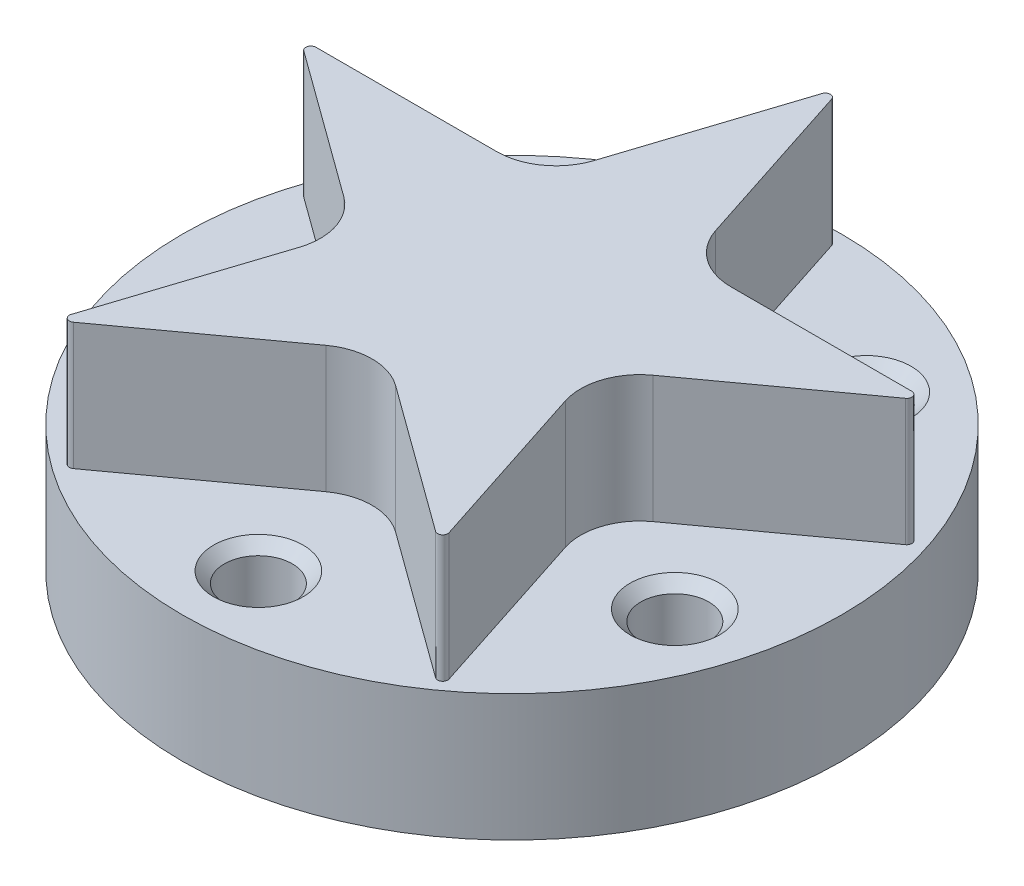
ISO-10303-21;
HEADER;
FILE_DESCRIPTION(('STEP AP214'),'2;1');
FILE_NAME('part.step','',(''),(''),'','','');
FILE_SCHEMA(('AUTOMOTIVE_DESIGN { 1 0 10303 214 1 1 1 1 }'));
ENDSEC;
DATA;
#1=APPLICATION_CONTEXT('core data for automotive mechanical design processes');
#2=APPLICATION_PROTOCOL_DEFINITION('international standard','automotive_design',2000,#1);
#3=PRODUCT_CONTEXT('',#1,'mechanical');
#4=PRODUCT('Part','Part','',(#3));
#5=PRODUCT_RELATED_PRODUCT_CATEGORY('part','',(#4));
#6=PRODUCT_DEFINITION_FORMATION('','',#4);
#7=PRODUCT_DEFINITION_CONTEXT('part definition',#1,'design');
#8=PRODUCT_DEFINITION('design','',#6,#7);
#9=PRODUCT_DEFINITION_SHAPE('','',#8);
#10=(LENGTH_UNIT() NAMED_UNIT(*) SI_UNIT(.MILLI.,.METRE.));
#11=(NAMED_UNIT(*) PLANE_ANGLE_UNIT() SI_UNIT($,.RADIAN.));
#12=(NAMED_UNIT(*) SI_UNIT($,.STERADIAN.) SOLID_ANGLE_UNIT());
#13=UNCERTAINTY_MEASURE_WITH_UNIT(LENGTH_MEASURE(1.E-05),#10,'distance_accuracy_value','');
#14=(GEOMETRIC_REPRESENTATION_CONTEXT(3) GLOBAL_UNCERTAINTY_ASSIGNED_CONTEXT((#13)) GLOBAL_UNIT_ASSIGNED_CONTEXT((#10,
#11,#12)) REPRESENTATION_CONTEXT('',''));
#15=CARTESIAN_POINT('',(0.,0.,0.));
#16=DIRECTION('',(0.,0.,1.));
#17=DIRECTION('',(1.,0.,0.));
#18=AXIS2_PLACEMENT_3D('',#15,#16,#17);
#19=CARTESIAN_POINT('',(0.,19.05,0.));
#20=DIRECTION('',(0.,-1.,0.));
#21=DIRECTION('',(0.,0.,-1.));
#22=AXIS2_PLACEMENT_3D('',#19,#20,#21);
#23=CYLINDRICAL_SURFACE('',#22,24.765);
#24=CARTESIAN_POINT('',(0.,0.,0.));
#25=DIRECTION('',(0.,1.,0.));
#26=DIRECTION('',(0.,0.,1.));
#27=AXIS2_PLACEMENT_3D('',#24,#25,#26);
#28=CIRCLE('',#27,24.765);
#29=CARTESIAN_POINT('',(0.,0.,24.765));
#30=VERTEX_POINT('',#29);
#31=EDGE_CURVE('E13',#30,#30,#28,.T.);
#32=ORIENTED_EDGE('',*,*,#31,.T.);
#33=EDGE_LOOP('',(#32));
#34=FACE_BOUND('',#33,.T.);
#35=CARTESIAN_POINT('',(0.,9.525,0.));
#36=DIRECTION('',(0.,1.,0.));
#37=DIRECTION('',(0.,0.,1.));
#38=AXIS2_PLACEMENT_3D('',#35,#36,#37);
#39=CIRCLE('',#38,24.765);
#40=CARTESIAN_POINT('',(0.,9.525,24.765));
#41=VERTEX_POINT('',#40);
#42=EDGE_CURVE('E53',#41,#41,#39,.T.);
#43=ORIENTED_EDGE('',*,*,#42,.F.);
#44=EDGE_LOOP('',(#43));
#45=FACE_BOUND('',#44,.T.);
#46=ADVANCED_FACE('F50',(#34,#45),#23,.T.);
#47=CARTESIAN_POINT('',(0.,0.,0.));
#48=DIRECTION('',(0.,1.,0.));
#49=DIRECTION('',(0.,0.,1.));
#50=AXIS2_PLACEMENT_3D('',#47,#48,#49);
#51=PLANE('',#50);
#52=ORIENTED_EDGE('',*,*,#31,.F.);
#53=EDGE_LOOP('',(#52));
#54=FACE_BOUND('',#53,.T.);
#55=ADVANCED_FACE('F253',(#54),#51,.F.);
#56=CARTESIAN_POINT('',(0.,9.525,0.));
#57=DIRECTION('',(0.,1.,0.));
#58=DIRECTION('',(0.,0.,1.));
#59=AXIS2_PLACEMENT_3D('',#56,#57,#58);
#60=PLANE('',#59);
#61=CARTESIAN_POINT('',(-18.1176266354227,9.525,5.88677374284274));
#62=DIRECTION('',(0.,1.,0.));
#63=DIRECTION('',(0.,0.,1.));
#64=AXIS2_PLACEMENT_3D('',#61,#62,#63);
#65=CIRCLE('',#64,3.3655);
#66=CARTESIAN_POINT('',(-18.1176266354227,9.525,9.25227374284274));
#67=VERTEX_POINT('',#66);
#68=EDGE_CURVE('E220',#67,#67,#65,.T.);
#69=ORIENTED_EDGE('',*,*,#68,.F.);
#70=EDGE_LOOP('',(#69));
#71=FACE_BOUND('',#70,.T.);
#72=CARTESIAN_POINT('',(-11.1973090561716,9.525,-15.4117737428428));
#73=DIRECTION('',(0.,1.,0.));
#74=DIRECTION('',(0.,0.,1.));
#75=AXIS2_PLACEMENT_3D('',#72,#73,#74);
#76=CIRCLE('',#75,3.3655);
#77=CARTESIAN_POINT('',(-11.1973090561716,9.525,-12.0462737428428));
#78=VERTEX_POINT('',#77);
#79=EDGE_CURVE('E213',#78,#78,#76,.T.);
#80=ORIENTED_EDGE('',*,*,#79,.F.);
#81=EDGE_LOOP('',(#80));
#82=FACE_BOUND('',#81,.T.);
#83=CARTESIAN_POINT('',(11.1973090561716,9.525,-15.4117737428428));
#84=DIRECTION('',(0.,1.,0.));
#85=DIRECTION('',(0.,0.,1.));
#86=AXIS2_PLACEMENT_3D('',#83,#84,#85);
#87=CIRCLE('',#86,3.3655);
#88=CARTESIAN_POINT('',(11.1973090561716,9.525,-12.0462737428428));
#89=VERTEX_POINT('',#88);
#90=EDGE_CURVE('E230',#89,#89,#87,.T.);
#91=ORIENTED_EDGE('',*,*,#90,.F.);
#92=EDGE_LOOP('',(#91));
#93=FACE_BOUND('',#92,.T.);
#94=CARTESIAN_POINT('',(18.1176266354227,9.525,5.88677374284274));
#95=DIRECTION('',(0.,1.,0.));
#96=DIRECTION('',(0.,0.,1.));
#97=AXIS2_PLACEMENT_3D('',#94,#95,#96);
#98=CIRCLE('',#97,3.3655);
#99=CARTESIAN_POINT('',(18.1176266354227,9.525,9.25227374284274));
#100=VERTEX_POINT('',#99);
#101=EDGE_CURVE('E262',#100,#100,#98,.T.);
#102=ORIENTED_EDGE('',*,*,#101,.F.);
#103=EDGE_LOOP('',(#102));
#104=FACE_BOUND('',#103,.T.);
#105=CARTESIAN_POINT('',(1.93298336302911E-13,9.525,19.05));
#106=DIRECTION('',(0.,1.,0.));
#107=DIRECTION('',(0.,0.,1.));
#108=AXIS2_PLACEMENT_3D('',#105,#106,#107);
#109=CIRCLE('',#108,3.3655);
#110=CARTESIAN_POINT('',(1.93298336302911E-13,9.525,22.4155));
#111=VERTEX_POINT('',#110);
#112=EDGE_CURVE('E265',#111,#111,#109,.T.);
#113=ORIENTED_EDGE('',*,*,#112,.F.);
#114=EDGE_LOOP('',(#113));
#115=FACE_BOUND('',#114,.T.);
#116=DIRECTION('',(-0.309016994374948,0.,0.951056516295154));
#117=VECTOR('',#116,1.);
#118=CARTESIAN_POINT('',(-4.56212424204858,9.525,-10.724225325699));
#119=LINE('',#118,#117);
#120=CARTESIAN_POINT('',(-0.362352532708458,9.525,-23.6497935754294));
#121=VERTEX_POINT('',#120);
#122=CARTESIAN_POINT('',(-4.56212424204858,9.525,-10.724225325699));
#123=VERTEX_POINT('',#122);
#124=EDGE_CURVE('E271',#121,#123,#119,.T.);
#125=ORIENTED_EDGE('',*,*,#124,.F.);
#126=CARTESIAN_POINT('',(0.,9.525,-23.5320581005726));
#127=DIRECTION('',(0.,1.,0.));
#128=DIRECTION('',(0.,0.,1.));
#129=AXIS2_PLACEMENT_3D('',#126,#127,#128);
#130=CIRCLE('',#129,0.381);
#131=CARTESIAN_POINT('',(0.362352532708458,9.525,-23.6497935754294));
#132=VERTEX_POINT('',#131);
#133=EDGE_CURVE('E328',#132,#121,#130,.T.);
#134=ORIENTED_EDGE('',*,*,#133,.F.);
#135=DIRECTION('',(-0.309016994374948,0.,-0.951056516295154));
#136=VECTOR('',#135,1.);
#137=CARTESIAN_POINT('',(0.362352532708458,9.525,-23.6497935754294));
#138=LINE('',#137,#136);
#139=CARTESIAN_POINT('',(4.56212424204858,9.525,-10.724225325699));
#140=VERTEX_POINT('',#139);
#141=EDGE_CURVE('E331',#140,#132,#138,.T.);
#142=ORIENTED_EDGE('',*,*,#141,.F.);
#143=CARTESIAN_POINT('',(8.78957045698055,9.525,-12.0978058656956));
#144=DIRECTION('',(0.,-1.,0.));
#145=DIRECTION('',(0.,0.,1.));
#146=AXIS2_PLACEMENT_3D('',#143,#144,#145);
#147=CIRCLE('',#146,4.445);
#148=CARTESIAN_POINT('',(8.78957045698055,9.525,-7.65280586569557));
#149=VERTEX_POINT('',#148);
#150=EDGE_CURVE('E538',#149,#140,#147,.T.);
#151=ORIENTED_EDGE('',*,*,#150,.F.);
#152=DIRECTION('',(-1.,0.,0.));
#153=VECTOR('',#152,1.);
#154=CARTESIAN_POINT('',(8.78957045698057,9.525,-7.65280586569557));
#155=LINE('',#154,#153);
#156=CARTESIAN_POINT('',(22.3803171983857,9.525,-7.65280586569557));
#157=VERTEX_POINT('',#156);
#158=EDGE_CURVE('E540',#157,#149,#155,.T.);
#159=ORIENTED_EDGE('',*,*,#158,.F.);
#160=CARTESIAN_POINT('',(22.3803171983857,9.525,-7.27180586569557));
#161=DIRECTION('',(0.,1.,0.));
#162=DIRECTION('',(0.,0.,1.));
#163=AXIS2_PLACEMENT_3D('',#160,#161,#162);
#164=CIRCLE('',#163,0.380999999999999);
#165=CARTESIAN_POINT('',(22.6042633795091,9.525,-6.96357039083871));
#166=VERTEX_POINT('',#165);
#167=EDGE_CURVE('E553',#166,#157,#164,.T.);
#168=ORIENTED_EDGE('',*,*,#167,.F.);
#169=DIRECTION('',(0.809016994374947,0.,-0.587785252292473));
#170=VECTOR('',#169,1.);
#171=CARTESIAN_POINT('',(22.6042633795091,9.525,-6.96357039083871));
#172=LINE('',#171,#170);
#173=CARTESIAN_POINT('',(11.6091182994664,9.525,1.0248701114012));
#174=VERTEX_POINT('',#173);
#175=EDGE_CURVE('E558',#174,#166,#172,.T.);
#176=ORIENTED_EDGE('',*,*,#175,.F.);
#177=CARTESIAN_POINT('',(14.2218237459065,9.525,4.62095065139786));
#178=DIRECTION('',(0.,-1.,0.));
#179=DIRECTION('',(0.,0.,1.));
#180=AXIS2_PLACEMENT_3D('',#177,#178,#179);
#181=CIRCLE('',#180,4.445);
#182=CARTESIAN_POINT('',(9.99437753097452,9.525,5.99453119139452));
#183=VERTEX_POINT('',#182);
#184=EDGE_CURVE('E563',#183,#174,#181,.T.);
#185=ORIENTED_EDGE('',*,*,#184,.F.);
#186=DIRECTION('',(-0.309016994374948,0.,-0.951056516295154));
#187=VECTOR('',#186,1.);
#188=CARTESIAN_POINT('',(9.99437753097452,9.525,5.99453119139452));
#189=LINE('',#188,#187);
#190=CARTESIAN_POINT('',(14.1941492403146,9.525,18.920099441125));
#191=VERTEX_POINT('',#190);
#192=EDGE_CURVE('E576',#191,#183,#189,.T.);
#193=ORIENTED_EDGE('',*,*,#192,.F.);
#194=CARTESIAN_POINT('',(13.8317967076062,9.525,19.0378349159819));
#195=DIRECTION('',(0.,1.,0.));
#196=DIRECTION('',(0.,0.,1.));
#197=AXIS2_PLACEMENT_3D('',#194,#195,#196);
#198=CIRCLE('',#197,0.381000000000001);
#199=CARTESIAN_POINT('',(13.6078505264827,9.525,19.3460703908387));
#200=VERTEX_POINT('',#199);
#201=EDGE_CURVE('E572',#200,#191,#198,.T.);
#202=ORIENTED_EDGE('',*,*,#201,.F.);
#203=DIRECTION('',(0.809016994374947,0.,0.587785252292473));
#204=VECTOR('',#203,1.);
#205=CARTESIAN_POINT('',(13.6078505264827,9.525,19.3460703908387));
#206=LINE('',#205,#204);
#207=CARTESIAN_POINT('',(2.61270544644007,9.525,11.3576298885988));
#208=VERTEX_POINT('',#207);
#209=EDGE_CURVE('E577',#208,#200,#206,.T.);
#210=ORIENTED_EDGE('',*,*,#209,.F.);
#211=CARTESIAN_POINT('',(0.,9.525,14.9537104285954));
#212=DIRECTION('',(0.,-1.,0.));
#213=DIRECTION('',(0.,0.,1.));
#214=AXIS2_PLACEMENT_3D('',#211,#212,#213);
#215=CIRCLE('',#214,4.445);
#216=CARTESIAN_POINT('',(-2.61270544644006,9.525,11.3576298885988));
#217=VERTEX_POINT('',#216);
#218=EDGE_CURVE('E601',#217,#208,#215,.T.);
#219=ORIENTED_EDGE('',*,*,#218,.F.);
#220=DIRECTION('',(0.809016994374947,0.,-0.587785252292473));
#221=VECTOR('',#220,1.);
#222=CARTESIAN_POINT('',(-2.61270544644006,9.525,11.3576298885988));
#223=LINE('',#222,#221);
#224=CARTESIAN_POINT('',(-13.6078505264827,9.525,19.3460703908387));
#225=VERTEX_POINT('',#224);
#226=EDGE_CURVE('E603',#225,#217,#223,.T.);
#227=ORIENTED_EDGE('',*,*,#226,.F.);
#228=CARTESIAN_POINT('',(-13.8317967076062,9.525,19.0378349159819));
#229=DIRECTION('',(0.,1.,0.));
#230=DIRECTION('',(0.,0.,1.));
#231=AXIS2_PLACEMENT_3D('',#228,#229,#230);
#232=CIRCLE('',#231,0.381);
#233=CARTESIAN_POINT('',(-14.1941492403146,9.525,18.920099441125));
#234=VERTEX_POINT('',#233);
#235=EDGE_CURVE('E606',#234,#225,#232,.T.);
#236=ORIENTED_EDGE('',*,*,#235,.F.);
#237=DIRECTION('',(-0.309016994374948,0.,0.951056516295153));
#238=VECTOR('',#237,1.);
#239=CARTESIAN_POINT('',(-14.1941492403146,9.525,18.920099441125));
#240=LINE('',#239,#238);
#241=CARTESIAN_POINT('',(-9.99437753097451,9.525,5.99453119139453));
#242=VERTEX_POINT('',#241);
#243=EDGE_CURVE('E619',#242,#234,#240,.T.);
#244=ORIENTED_EDGE('',*,*,#243,.F.);
#245=CARTESIAN_POINT('',(-14.2218237459065,9.525,4.62095065139786));
#246=DIRECTION('',(0.,-1.,0.));
#247=DIRECTION('',(0.,0.,1.));
#248=AXIS2_PLACEMENT_3D('',#245,#246,#247);
#249=CIRCLE('',#248,4.445);
#250=CARTESIAN_POINT('',(-11.6091182994664,9.525,1.02487011140121));
#251=VERTEX_POINT('',#250);
#252=EDGE_CURVE('E624',#251,#242,#249,.T.);
#253=ORIENTED_EDGE('',*,*,#252,.F.);
#254=DIRECTION('',(0.809016994374947,0.,0.587785252292473));
#255=VECTOR('',#254,1.);
#256=CARTESIAN_POINT('',(-11.6091182994664,9.525,1.02487011140121));
#257=LINE('',#256,#255);
#258=CARTESIAN_POINT('',(-22.6042633795091,9.525,-6.96357039083871));
#259=VERTEX_POINT('',#258);
#260=EDGE_CURVE('E630',#259,#251,#257,.T.);
#261=ORIENTED_EDGE('',*,*,#260,.F.);
#262=CARTESIAN_POINT('',(-22.3803171983857,9.525,-7.27180586569557));
#263=DIRECTION('',(0.,1.,0.));
#264=DIRECTION('',(0.,0.,1.));
#265=AXIS2_PLACEMENT_3D('',#262,#263,#264);
#266=CIRCLE('',#265,0.380999999999999);
#267=CARTESIAN_POINT('',(-22.3803171983857,9.525,-7.65280586569557));
#268=VERTEX_POINT('',#267);
#269=EDGE_CURVE('E74',#268,#259,#266,.T.);
#270=ORIENTED_EDGE('',*,*,#269,.F.);
#271=DIRECTION('',(-1.,0.,0.));
#272=VECTOR('',#271,1.);
#273=CARTESIAN_POINT('',(-22.3803171983857,9.525,-7.65280586569557));
#274=LINE('',#273,#272);
#275=CARTESIAN_POINT('',(-8.78957045698057,9.525,-7.65280586569557));
#276=VERTEX_POINT('',#275);
#277=EDGE_CURVE('E395',#276,#268,#274,.T.);
#278=ORIENTED_EDGE('',*,*,#277,.F.);
#279=CARTESIAN_POINT('',(-8.78957045698055,9.525,-12.0978058656956));
#280=DIRECTION('',(0.,-1.,0.));
#281=DIRECTION('',(0.,0.,-1.));
#282=AXIS2_PLACEMENT_3D('',#279,#280,#281);
#283=CIRCLE('',#282,4.445);
#284=EDGE_CURVE('E393',#123,#276,#283,.T.);
#285=ORIENTED_EDGE('',*,*,#284,.F.);
#286=EDGE_LOOP('',(#125,#134,#142,#151,#159,#168,#176,#185,#193,#202,#210,#219,#227,#236,#244,
#253,#261,#270,#278,#285));
#287=FACE_BOUND('',#286,.T.);
#288=ORIENTED_EDGE('',*,*,#42,.T.);
#289=EDGE_LOOP('',(#288));
#290=FACE_BOUND('',#289,.T.);
#291=ADVANCED_FACE('F249',(#71,#82,#93,#104,#115,#287,#290),#60,.T.);
#292=CARTESIAN_POINT('',(-8.78957045698055,9.525,-12.0978058656956));
#293=DIRECTION('',(0.,1.,0.));
#294=DIRECTION('',(0.,0.,1.));
#295=AXIS2_PLACEMENT_3D('',#292,#293,#294);
#296=CYLINDRICAL_SURFACE('',#295,4.445);
#297=CARTESIAN_POINT('',(-8.78957045698055,19.05,-12.0978058656956));
#298=DIRECTION('',(0.,-1.,0.));
#299=DIRECTION('',(0.,0.,-1.));
#300=AXIS2_PLACEMENT_3D('',#297,#298,#299);
#301=CIRCLE('',#300,4.445);
#302=CARTESIAN_POINT('',(-4.56212424204858,19.05,-10.724225325699));
#303=VERTEX_POINT('',#302);
#304=CARTESIAN_POINT('',(-8.78957045698057,19.05,-7.65280586569557));
#305=VERTEX_POINT('',#304);
#306=EDGE_CURVE('E336',#303,#305,#301,.T.);
#307=ORIENTED_EDGE('',*,*,#306,.F.);
#308=DIRECTION('',(0.,1.,0.));
#309=VECTOR('',#308,1.);
#310=CARTESIAN_POINT('',(-4.56212424204858,9.525,-10.724225325699));
#311=LINE('',#310,#309);
#312=EDGE_CURVE('E277',#123,#303,#311,.T.);
#313=ORIENTED_EDGE('',*,*,#312,.F.);
#314=ORIENTED_EDGE('',*,*,#284,.T.);
#315=DIRECTION('',(0.,1.,0.));
#316=VECTOR('',#315,1.);
#317=CARTESIAN_POINT('',(-8.78957045698057,9.525,-7.65280586569557));
#318=LINE('',#317,#316);
#319=EDGE_CURVE('E323',#276,#305,#318,.T.);
#320=ORIENTED_EDGE('',*,*,#319,.T.);
#321=EDGE_LOOP('',(#307,#313,#314,#320));
#322=FACE_BOUND('',#321,.T.);
#323=ADVANCED_FACE('F252',(#322),#296,.F.);
#324=CARTESIAN_POINT('',(-4.56212424204858,9.525,-10.724225325699));
#325=DIRECTION('',(-0.951056516295154,0.,-0.309016994374948));
#326=DIRECTION('',(-0.309016994374948,0.,0.951056516295154));
#327=AXIS2_PLACEMENT_3D('',#324,#325,#326);
#328=PLANE('',#327);
#329=DIRECTION('',(-0.309016994374948,0.,0.951056516295154));
#330=VECTOR('',#329,1.);
#331=CARTESIAN_POINT('',(-4.56212424204858,19.05,-10.724225325699));
#332=LINE('',#331,#330);
#333=CARTESIAN_POINT('',(-0.362352532708458,19.05,-23.6497935754294));
#334=VERTEX_POINT('',#333);
#335=EDGE_CURVE('E287',#334,#303,#332,.T.);
#336=ORIENTED_EDGE('',*,*,#335,.F.);
#337=DIRECTION('',(0.,1.,0.));
#338=VECTOR('',#337,1.);
#339=CARTESIAN_POINT('',(-0.362352532708458,9.525,-23.6497935754294));
#340=LINE('',#339,#338);
#341=EDGE_CURVE('E279',#121,#334,#340,.T.);
#342=ORIENTED_EDGE('',*,*,#341,.F.);
#343=ORIENTED_EDGE('',*,*,#124,.T.);
#344=ORIENTED_EDGE('',*,*,#312,.T.);
#345=EDGE_LOOP('',(#336,#342,#343,#344));
#346=FACE_BOUND('',#345,.T.);
#347=ADVANCED_FACE('F458',(#346),#328,.T.);
#348=CARTESIAN_POINT('',(0.,9.525,-23.5320581005726));
#349=DIRECTION('',(0.,1.,0.));
#350=DIRECTION('',(0.,0.,1.));
#351=AXIS2_PLACEMENT_3D('',#348,#349,#350);
#352=CYLINDRICAL_SURFACE('',#351,0.381);
#353=CARTESIAN_POINT('',(0.,19.05,-23.5320581005726));
#354=DIRECTION('',(0.,1.,0.));
#355=DIRECTION('',(0.,0.,1.));
#356=AXIS2_PLACEMENT_3D('',#353,#354,#355);
#357=CIRCLE('',#356,0.381);
#358=CARTESIAN_POINT('',(0.362352532708458,19.05,-23.6497935754294));
#359=VERTEX_POINT('',#358);
#360=EDGE_CURVE('E388',#359,#334,#357,.T.);
#361=ORIENTED_EDGE('',*,*,#360,.F.);
#362=DIRECTION('',(0.,1.,0.));
#363=VECTOR('',#362,1.);
#364=CARTESIAN_POINT('',(0.362352532708458,9.525,-23.6497935754294));
#365=LINE('',#364,#363);
#366=EDGE_CURVE('E284',#132,#359,#365,.T.);
#367=ORIENTED_EDGE('',*,*,#366,.F.);
#368=ORIENTED_EDGE('',*,*,#133,.T.);
#369=ORIENTED_EDGE('',*,*,#341,.T.);
#370=EDGE_LOOP('',(#361,#367,#368,#369));
#371=FACE_BOUND('',#370,.T.);
#372=ADVANCED_FACE('F524',(#371),#352,.T.);
#373=CARTESIAN_POINT('',(0.362352532708458,9.525,-23.6497935754294));
#374=DIRECTION('',(0.951056516295154,0.,-0.309016994374948));
#375=DIRECTION('',(-0.309016994374948,0.,-0.951056516295154));
#376=AXIS2_PLACEMENT_3D('',#373,#374,#375);
#377=PLANE('',#376);
#378=DIRECTION('',(-0.309016994374948,0.,-0.951056516295154));
#379=VECTOR('',#378,1.);
#380=CARTESIAN_POINT('',(0.362352532708458,19.05,-23.6497935754294));
#381=LINE('',#380,#379);
#382=CARTESIAN_POINT('',(4.56212424204858,19.05,-10.724225325699));
#383=VERTEX_POINT('',#382);
#384=EDGE_CURVE('E386',#383,#359,#381,.T.);
#385=ORIENTED_EDGE('',*,*,#384,.F.);
#386=DIRECTION('',(0.,1.,0.));
#387=VECTOR('',#386,1.);
#388=CARTESIAN_POINT('',(4.56212424204858,9.525,-10.724225325699));
#389=LINE('',#388,#387);
#390=EDGE_CURVE('E291',#140,#383,#389,.T.);
#391=ORIENTED_EDGE('',*,*,#390,.F.);
#392=ORIENTED_EDGE('',*,*,#141,.T.);
#393=ORIENTED_EDGE('',*,*,#366,.T.);
#394=EDGE_LOOP('',(#385,#391,#392,#393));
#395=FACE_BOUND('',#394,.T.);
#396=ADVANCED_FACE('F520',(#395),#377,.T.);
#397=CARTESIAN_POINT('',(8.78957045698055,9.525,-12.0978058656956));
#398=DIRECTION('',(0.,1.,0.));
#399=DIRECTION('',(0.,0.,1.));
#400=AXIS2_PLACEMENT_3D('',#397,#398,#399);
#401=CYLINDRICAL_SURFACE('',#400,4.445);
#402=CARTESIAN_POINT('',(8.78957045698055,19.05,-12.0978058656956));
#403=DIRECTION('',(0.,-1.,0.));
#404=DIRECTION('',(0.,0.,1.));
#405=AXIS2_PLACEMENT_3D('',#402,#403,#404);
#406=CIRCLE('',#405,4.445);
#407=CARTESIAN_POINT('',(8.78957045698055,19.05,-7.65280586569557));
#408=VERTEX_POINT('',#407);
#409=EDGE_CURVE('E383',#408,#383,#406,.T.);
#410=ORIENTED_EDGE('',*,*,#409,.F.);
#411=DIRECTION('',(0.,1.,0.));
#412=VECTOR('',#411,1.);
#413=CARTESIAN_POINT('',(8.78957045698055,9.525,-7.65280586569557));
#414=LINE('',#413,#412);
#415=EDGE_CURVE('E293',#149,#408,#414,.T.);
#416=ORIENTED_EDGE('',*,*,#415,.F.);
#417=ORIENTED_EDGE('',*,*,#150,.T.);
#418=ORIENTED_EDGE('',*,*,#390,.T.);
#419=EDGE_LOOP('',(#410,#416,#417,#418));
#420=FACE_BOUND('',#419,.T.);
#421=ADVANCED_FACE('F516',(#420),#401,.F.);
#422=CARTESIAN_POINT('',(8.78957045698057,9.525,-7.65280586569557));
#423=DIRECTION('',(0.,0.,-1.));
#424=DIRECTION('',(-1.,0.,0.));
#425=AXIS2_PLACEMENT_3D('',#422,#423,#424);
#426=PLANE('',#425);
#427=DIRECTION('',(-1.,0.,0.));
#428=VECTOR('',#427,1.);
#429=CARTESIAN_POINT('',(8.78957045698057,19.05,-7.65280586569557));
#430=LINE('',#429,#428);
#431=CARTESIAN_POINT('',(22.3803171983857,19.05,-7.65280586569557));
#432=VERTEX_POINT('',#431);
#433=EDGE_CURVE('E380',#432,#408,#430,.T.);
#434=ORIENTED_EDGE('',*,*,#433,.F.);
#435=DIRECTION('',(0.,1.,0.));
#436=VECTOR('',#435,1.);
#437=CARTESIAN_POINT('',(22.3803171983857,9.525,-7.65280586569557));
#438=LINE('',#437,#436);
#439=EDGE_CURVE('E295',#157,#432,#438,.T.);
#440=ORIENTED_EDGE('',*,*,#439,.F.);
#441=ORIENTED_EDGE('',*,*,#158,.T.);
#442=ORIENTED_EDGE('',*,*,#415,.T.);
#443=EDGE_LOOP('',(#434,#440,#441,#442));
#444=FACE_BOUND('',#443,.T.);
#445=ADVANCED_FACE('F512',(#444),#426,.T.);
#446=CARTESIAN_POINT('',(22.3803171983857,9.525,-7.27180586569557));
#447=DIRECTION('',(0.,1.,0.));
#448=DIRECTION('',(0.,0.,1.));
#449=AXIS2_PLACEMENT_3D('',#446,#447,#448);
#450=CYLINDRICAL_SURFACE('',#449,0.380999999999999);
#451=CARTESIAN_POINT('',(22.3803171983857,19.05,-7.27180586569557));
#452=DIRECTION('',(0.,1.,0.));
#453=DIRECTION('',(0.,0.,1.));
#454=AXIS2_PLACEMENT_3D('',#451,#452,#453);
#455=CIRCLE('',#454,0.380999999999999);
#456=CARTESIAN_POINT('',(22.6042633795091,19.05,-6.96357039083871));
#457=VERTEX_POINT('',#456);
#458=EDGE_CURVE('E377',#457,#432,#455,.T.);
#459=ORIENTED_EDGE('',*,*,#458,.F.);
#460=DIRECTION('',(0.,1.,0.));
#461=VECTOR('',#460,1.);
#462=CARTESIAN_POINT('',(22.6042633795091,9.525,-6.96357039083871));
#463=LINE('',#462,#461);
#464=EDGE_CURVE('E297',#166,#457,#463,.T.);
#465=ORIENTED_EDGE('',*,*,#464,.F.);
#466=ORIENTED_EDGE('',*,*,#167,.T.);
#467=ORIENTED_EDGE('',*,*,#439,.T.);
#468=EDGE_LOOP('',(#459,#465,#466,#467));
#469=FACE_BOUND('',#468,.T.);
#470=ADVANCED_FACE('F508',(#469),#450,.T.);
#471=CARTESIAN_POINT('',(22.6042633795091,9.525,-6.96357039083871));
#472=DIRECTION('',(0.587785252292473,0.,0.809016994374947));
#473=DIRECTION('',(0.809016994374948,0.,-0.587785252292473));
#474=AXIS2_PLACEMENT_3D('',#471,#472,#473);
#475=PLANE('',#474);
#476=DIRECTION('',(0.809016994374947,0.,-0.587785252292473));
#477=VECTOR('',#476,1.);
#478=CARTESIAN_POINT('',(22.6042633795091,19.05,-6.96357039083871));
#479=LINE('',#478,#477);
#480=CARTESIAN_POINT('',(11.6091182994664,19.05,1.0248701114012));
#481=VERTEX_POINT('',#480);
#482=EDGE_CURVE('E374',#481,#457,#479,.T.);
#483=ORIENTED_EDGE('',*,*,#482,.F.);
#484=DIRECTION('',(0.,1.,0.));
#485=VECTOR('',#484,1.);
#486=CARTESIAN_POINT('',(11.6091182994664,9.525,1.0248701114012));
#487=LINE('',#486,#485);
#488=EDGE_CURVE('E299',#174,#481,#487,.T.);
#489=ORIENTED_EDGE('',*,*,#488,.F.);
#490=ORIENTED_EDGE('',*,*,#175,.T.);
#491=ORIENTED_EDGE('',*,*,#464,.T.);
#492=EDGE_LOOP('',(#483,#489,#490,#491));
#493=FACE_BOUND('',#492,.T.);
#494=ADVANCED_FACE('F504',(#493),#475,.T.);
#495=CARTESIAN_POINT('',(14.2218237459065,9.525,4.62095065139786));
#496=DIRECTION('',(0.,1.,0.));
#497=DIRECTION('',(0.,0.,1.));
#498=AXIS2_PLACEMENT_3D('',#495,#496,#497);
#499=CYLINDRICAL_SURFACE('',#498,4.445);
#500=CARTESIAN_POINT('',(14.2218237459065,19.05,4.62095065139786));
#501=DIRECTION('',(0.,-1.,0.));
#502=DIRECTION('',(0.,0.,1.));
#503=AXIS2_PLACEMENT_3D('',#500,#501,#502);
#504=CIRCLE('',#503,4.445);
#505=CARTESIAN_POINT('',(9.99437753097452,19.05,5.99453119139452));
#506=VERTEX_POINT('',#505);
#507=EDGE_CURVE('E371',#506,#481,#504,.T.);
#508=ORIENTED_EDGE('',*,*,#507,.F.);
#509=DIRECTION('',(0.,1.,0.));
#510=VECTOR('',#509,1.);
#511=CARTESIAN_POINT('',(9.99437753097452,9.525,5.99453119139452));
#512=LINE('',#511,#510);
#513=EDGE_CURVE('E301',#183,#506,#512,.T.);
#514=ORIENTED_EDGE('',*,*,#513,.F.);
#515=ORIENTED_EDGE('',*,*,#184,.T.);
#516=ORIENTED_EDGE('',*,*,#488,.T.);
#517=EDGE_LOOP('',(#508,#514,#515,#516));
#518=FACE_BOUND('',#517,.T.);
#519=ADVANCED_FACE('F500',(#518),#499,.F.);
#520=CARTESIAN_POINT('',(9.99437753097452,9.525,5.99453119139452));
#521=DIRECTION('',(0.951056516295154,0.,-0.309016994374948));
#522=DIRECTION('',(-0.309016994374948,0.,-0.951056516295154));
#523=AXIS2_PLACEMENT_3D('',#520,#521,#522);
#524=PLANE('',#523);
#525=DIRECTION('',(-0.309016994374948,0.,-0.951056516295154));
#526=VECTOR('',#525,1.);
#527=CARTESIAN_POINT('',(9.99437753097452,19.05,5.99453119139452));
#528=LINE('',#527,#526);
#529=CARTESIAN_POINT('',(14.1941492403146,19.05,18.920099441125));
#530=VERTEX_POINT('',#529);
#531=EDGE_CURVE('E368',#530,#506,#528,.T.);
#532=ORIENTED_EDGE('',*,*,#531,.F.);
#533=DIRECTION('',(0.,1.,0.));
#534=VECTOR('',#533,1.);
#535=CARTESIAN_POINT('',(14.1941492403146,9.525,18.920099441125));
#536=LINE('',#535,#534);
#537=EDGE_CURVE('E303',#191,#530,#536,.T.);
#538=ORIENTED_EDGE('',*,*,#537,.F.);
#539=ORIENTED_EDGE('',*,*,#192,.T.);
#540=ORIENTED_EDGE('',*,*,#513,.T.);
#541=EDGE_LOOP('',(#532,#538,#539,#540));
#542=FACE_BOUND('',#541,.T.);
#543=ADVANCED_FACE('F496',(#542),#524,.T.);
#544=CARTESIAN_POINT('',(13.8317967076062,9.525,19.0378349159819));
#545=DIRECTION('',(0.,1.,0.));
#546=DIRECTION('',(0.,0.,1.));
#547=AXIS2_PLACEMENT_3D('',#544,#545,#546);
#548=CYLINDRICAL_SURFACE('',#547,0.381000000000001);
#549=CARTESIAN_POINT('',(13.8317967076062,19.05,19.0378349159819));
#550=DIRECTION('',(0.,1.,0.));
#551=DIRECTION('',(0.,0.,1.));
#552=AXIS2_PLACEMENT_3D('',#549,#550,#551);
#553=CIRCLE('',#552,0.381000000000001);
#554=CARTESIAN_POINT('',(13.6078505264827,19.05,19.3460703908387));
#555=VERTEX_POINT('',#554);
#556=EDGE_CURVE('E365',#555,#530,#553,.T.);
#557=ORIENTED_EDGE('',*,*,#556,.F.);
#558=DIRECTION('',(0.,1.,0.));
#559=VECTOR('',#558,1.);
#560=CARTESIAN_POINT('',(13.6078505264827,9.525,19.3460703908387));
#561=LINE('',#560,#559);
#562=EDGE_CURVE('E305',#200,#555,#561,.T.);
#563=ORIENTED_EDGE('',*,*,#562,.F.);
#564=ORIENTED_EDGE('',*,*,#201,.T.);
#565=ORIENTED_EDGE('',*,*,#537,.T.);
#566=EDGE_LOOP('',(#557,#563,#564,#565));
#567=FACE_BOUND('',#566,.T.);
#568=ADVANCED_FACE('F492',(#567),#548,.T.);
#569=CARTESIAN_POINT('',(13.6078505264827,9.525,19.3460703908387));
#570=DIRECTION('',(-0.587785252292473,0.,0.809016994374948));
#571=DIRECTION('',(0.809016994374947,0.,0.587785252292473));
#572=AXIS2_PLACEMENT_3D('',#569,#570,#571);
#573=PLANE('',#572);
#574=DIRECTION('',(0.809016994374947,0.,0.587785252292473));
#575=VECTOR('',#574,1.);
#576=CARTESIAN_POINT('',(13.6078505264827,19.05,19.3460703908387));
#577=LINE('',#576,#575);
#578=CARTESIAN_POINT('',(2.61270544644007,19.05,11.3576298885988));
#579=VERTEX_POINT('',#578);
#580=EDGE_CURVE('E362',#579,#555,#577,.T.);
#581=ORIENTED_EDGE('',*,*,#580,.F.);
#582=DIRECTION('',(0.,1.,0.));
#583=VECTOR('',#582,1.);
#584=CARTESIAN_POINT('',(2.61270544644007,9.525,11.3576298885988));
#585=LINE('',#584,#583);
#586=EDGE_CURVE('E307',#208,#579,#585,.T.);
#587=ORIENTED_EDGE('',*,*,#586,.F.);
#588=ORIENTED_EDGE('',*,*,#209,.T.);
#589=ORIENTED_EDGE('',*,*,#562,.T.);
#590=EDGE_LOOP('',(#581,#587,#588,#589));
#591=FACE_BOUND('',#590,.T.);
#592=ADVANCED_FACE('F488',(#591),#573,.T.);
#593=CARTESIAN_POINT('',(0.,9.525,14.9537104285954));
#594=DIRECTION('',(0.,1.,0.));
#595=DIRECTION('',(0.,0.,1.));
#596=AXIS2_PLACEMENT_3D('',#593,#594,#595);
#597=CYLINDRICAL_SURFACE('',#596,4.445);
#598=CARTESIAN_POINT('',(0.,19.05,14.9537104285954));
#599=DIRECTION('',(0.,-1.,0.));
#600=DIRECTION('',(0.,0.,1.));
#601=AXIS2_PLACEMENT_3D('',#598,#599,#600);
#602=CIRCLE('',#601,4.445);
#603=CARTESIAN_POINT('',(-2.61270544644006,19.05,11.3576298885988));
#604=VERTEX_POINT('',#603);
#605=EDGE_CURVE('E359',#604,#579,#602,.T.);
#606=ORIENTED_EDGE('',*,*,#605,.F.);
#607=DIRECTION('',(0.,1.,0.));
#608=VECTOR('',#607,1.);
#609=CARTESIAN_POINT('',(-2.61270544644006,9.525,11.3576298885988));
#610=LINE('',#609,#608);
#611=EDGE_CURVE('E309',#217,#604,#610,.T.);
#612=ORIENTED_EDGE('',*,*,#611,.F.);
#613=ORIENTED_EDGE('',*,*,#218,.T.);
#614=ORIENTED_EDGE('',*,*,#586,.T.);
#615=EDGE_LOOP('',(#606,#612,#613,#614));
#616=FACE_BOUND('',#615,.T.);
#617=ADVANCED_FACE('F484',(#616),#597,.F.);
#618=CARTESIAN_POINT('',(-2.61270544644006,9.525,11.3576298885988));
#619=DIRECTION('',(0.587785252292473,0.,0.809016994374948));
#620=DIRECTION('',(0.809016994374948,0.,-0.587785252292473));
#621=AXIS2_PLACEMENT_3D('',#618,#619,#620);
#622=PLANE('',#621);
#623=DIRECTION('',(0.809016994374947,0.,-0.587785252292473));
#624=VECTOR('',#623,1.);
#625=CARTESIAN_POINT('',(-2.61270544644006,19.05,11.3576298885988));
#626=LINE('',#625,#624);
#627=CARTESIAN_POINT('',(-13.6078505264827,19.05,19.3460703908387));
#628=VERTEX_POINT('',#627);
#629=EDGE_CURVE('E356',#628,#604,#626,.T.);
#630=ORIENTED_EDGE('',*,*,#629,.F.);
#631=DIRECTION('',(0.,1.,0.));
#632=VECTOR('',#631,1.);
#633=CARTESIAN_POINT('',(-13.6078505264827,9.525,19.3460703908387));
#634=LINE('',#633,#632);
#635=EDGE_CURVE('E311',#225,#628,#634,.T.);
#636=ORIENTED_EDGE('',*,*,#635,.F.);
#637=ORIENTED_EDGE('',*,*,#226,.T.);
#638=ORIENTED_EDGE('',*,*,#611,.T.);
#639=EDGE_LOOP('',(#630,#636,#637,#638));
#640=FACE_BOUND('',#639,.T.);
#641=ADVANCED_FACE('F480',(#640),#622,.T.);
#642=CARTESIAN_POINT('',(-13.8317967076062,9.525,19.0378349159819));
#643=DIRECTION('',(0.,1.,0.));
#644=DIRECTION('',(0.,0.,1.));
#645=AXIS2_PLACEMENT_3D('',#642,#643,#644);
#646=CYLINDRICAL_SURFACE('',#645,0.381);
#647=CARTESIAN_POINT('',(-13.8317967076062,19.05,19.0378349159819));
#648=DIRECTION('',(0.,1.,0.));
#649=DIRECTION('',(0.,0.,1.));
#650=AXIS2_PLACEMENT_3D('',#647,#648,#649);
#651=CIRCLE('',#650,0.381);
#652=CARTESIAN_POINT('',(-14.1941492403146,19.05,18.920099441125));
#653=VERTEX_POINT('',#652);
#654=EDGE_CURVE('E353',#653,#628,#651,.T.);
#655=ORIENTED_EDGE('',*,*,#654,.F.);
#656=DIRECTION('',(0.,1.,0.));
#657=VECTOR('',#656,1.);
#658=CARTESIAN_POINT('',(-14.1941492403146,9.525,18.920099441125));
#659=LINE('',#658,#657);
#660=EDGE_CURVE('E313',#234,#653,#659,.T.);
#661=ORIENTED_EDGE('',*,*,#660,.F.);
#662=ORIENTED_EDGE('',*,*,#235,.T.);
#663=ORIENTED_EDGE('',*,*,#635,.T.);
#664=EDGE_LOOP('',(#655,#661,#662,#663));
#665=FACE_BOUND('',#664,.T.);
#666=ADVANCED_FACE('F476',(#665),#646,.T.);
#667=CARTESIAN_POINT('',(-14.1941492403146,9.525,18.920099441125));
#668=DIRECTION('',(-0.951056516295154,0.,-0.309016994374948));
#669=DIRECTION('',(-0.309016994374948,0.,0.951056516295154));
#670=AXIS2_PLACEMENT_3D('',#667,#668,#669);
#671=PLANE('',#670);
#672=DIRECTION('',(-0.309016994374948,0.,0.951056516295153));
#673=VECTOR('',#672,1.);
#674=CARTESIAN_POINT('',(-14.1941492403146,19.05,18.920099441125));
#675=LINE('',#674,#673);
#676=CARTESIAN_POINT('',(-9.99437753097451,19.05,5.99453119139453));
#677=VERTEX_POINT('',#676);
#678=EDGE_CURVE('E350',#677,#653,#675,.T.);
#679=ORIENTED_EDGE('',*,*,#678,.F.);
#680=DIRECTION('',(0.,1.,0.));
#681=VECTOR('',#680,1.);
#682=CARTESIAN_POINT('',(-9.99437753097451,9.525,5.99453119139453));
#683=LINE('',#682,#681);
#684=EDGE_CURVE('E315',#242,#677,#683,.T.);
#685=ORIENTED_EDGE('',*,*,#684,.F.);
#686=ORIENTED_EDGE('',*,*,#243,.T.);
#687=ORIENTED_EDGE('',*,*,#660,.T.);
#688=EDGE_LOOP('',(#679,#685,#686,#687));
#689=FACE_BOUND('',#688,.T.);
#690=ADVANCED_FACE('F472',(#689),#671,.T.);
#691=CARTESIAN_POINT('',(-14.2218237459065,9.525,4.62095065139786));
#692=DIRECTION('',(0.,1.,0.));
#693=DIRECTION('',(0.,0.,1.));
#694=AXIS2_PLACEMENT_3D('',#691,#692,#693);
#695=CYLINDRICAL_SURFACE('',#694,4.445);
#696=CARTESIAN_POINT('',(-14.2218237459065,19.05,4.62095065139786));
#697=DIRECTION('',(0.,-1.,0.));
#698=DIRECTION('',(0.,0.,1.));
#699=AXIS2_PLACEMENT_3D('',#696,#697,#698);
#700=CIRCLE('',#699,4.445);
#701=CARTESIAN_POINT('',(-11.6091182994664,19.05,1.02487011140121));
#702=VERTEX_POINT('',#701);
#703=EDGE_CURVE('E347',#702,#677,#700,.T.);
#704=ORIENTED_EDGE('',*,*,#703,.F.);
#705=DIRECTION('',(0.,1.,0.));
#706=VECTOR('',#705,1.);
#707=CARTESIAN_POINT('',(-11.6091182994664,9.525,1.02487011140121));
#708=LINE('',#707,#706);
#709=EDGE_CURVE('E317',#251,#702,#708,.T.);
#710=ORIENTED_EDGE('',*,*,#709,.F.);
#711=ORIENTED_EDGE('',*,*,#252,.T.);
#712=ORIENTED_EDGE('',*,*,#684,.T.);
#713=EDGE_LOOP('',(#704,#710,#711,#712));
#714=FACE_BOUND('',#713,.T.);
#715=ADVANCED_FACE('F468',(#714),#695,.F.);
#716=CARTESIAN_POINT('',(-11.6091182994664,9.525,1.02487011140121));
#717=DIRECTION('',(-0.587785252292473,0.,0.809016994374947));
#718=DIRECTION('',(0.809016994374948,0.,0.587785252292473));
#719=AXIS2_PLACEMENT_3D('',#716,#717,#718);
#720=PLANE('',#719);
#721=DIRECTION('',(0.809016994374947,0.,0.587785252292473));
#722=VECTOR('',#721,1.);
#723=CARTESIAN_POINT('',(-11.6091182994664,19.05,1.02487011140121));
#724=LINE('',#723,#722);
#725=CARTESIAN_POINT('',(-22.6042633795091,19.05,-6.96357039083871));
#726=VERTEX_POINT('',#725);
#727=EDGE_CURVE('E344',#726,#702,#724,.T.);
#728=ORIENTED_EDGE('',*,*,#727,.F.);
#729=DIRECTION('',(0.,1.,0.));
#730=VECTOR('',#729,1.);
#731=CARTESIAN_POINT('',(-22.6042633795091,9.525,-6.96357039083871));
#732=LINE('',#731,#730);
#733=EDGE_CURVE('E319',#259,#726,#732,.T.);
#734=ORIENTED_EDGE('',*,*,#733,.F.);
#735=ORIENTED_EDGE('',*,*,#260,.T.);
#736=ORIENTED_EDGE('',*,*,#709,.T.);
#737=EDGE_LOOP('',(#728,#734,#735,#736));
#738=FACE_BOUND('',#737,.T.);
#739=ADVANCED_FACE('F465',(#738),#720,.T.);
#740=CARTESIAN_POINT('',(-22.3803171983857,9.525,-7.27180586569557));
#741=DIRECTION('',(0.,1.,0.));
#742=DIRECTION('',(0.,0.,1.));
#743=AXIS2_PLACEMENT_3D('',#740,#741,#742);
#744=CYLINDRICAL_SURFACE('',#743,0.380999999999999);
#745=CARTESIAN_POINT('',(-22.3803171983857,19.05,-7.27180586569557));
#746=DIRECTION('',(0.,1.,0.));
#747=DIRECTION('',(0.,0.,1.));
#748=AXIS2_PLACEMENT_3D('',#745,#746,#747);
#749=CIRCLE('',#748,0.380999999999999);
#750=CARTESIAN_POINT('',(-22.3803171983857,19.05,-7.65280586569557));
#751=VERTEX_POINT('',#750);
#752=EDGE_CURVE('E66',#751,#726,#749,.T.);
#753=ORIENTED_EDGE('',*,*,#752,.F.);
#754=DIRECTION('',(0.,1.,0.));
#755=VECTOR('',#754,1.);
#756=CARTESIAN_POINT('',(-22.3803171983857,9.525,-7.65280586569557));
#757=LINE('',#756,#755);
#758=EDGE_CURVE('E321',#268,#751,#757,.T.);
#759=ORIENTED_EDGE('',*,*,#758,.F.);
#760=ORIENTED_EDGE('',*,*,#269,.T.);
#761=ORIENTED_EDGE('',*,*,#733,.T.);
#762=EDGE_LOOP('',(#753,#759,#760,#761));
#763=FACE_BOUND('',#762,.T.);
#764=ADVANCED_FACE('F461',(#763),#744,.T.);
#765=CARTESIAN_POINT('',(-22.3803171983857,9.525,-7.65280586569557));
#766=DIRECTION('',(0.,0.,-1.));
#767=DIRECTION('',(-1.,0.,0.));
#768=AXIS2_PLACEMENT_3D('',#765,#766,#767);
#769=PLANE('',#768);
#770=DIRECTION('',(-1.,0.,0.));
#771=VECTOR('',#770,1.);
#772=CARTESIAN_POINT('',(-22.3803171983857,19.05,-7.65280586569557));
#773=LINE('',#772,#771);
#774=EDGE_CURVE('E339',#305,#751,#773,.T.);
#775=ORIENTED_EDGE('',*,*,#774,.F.);
#776=ORIENTED_EDGE('',*,*,#319,.F.);
#777=ORIENTED_EDGE('',*,*,#277,.T.);
#778=ORIENTED_EDGE('',*,*,#758,.T.);
#779=EDGE_LOOP('',(#775,#776,#777,#778));
#780=FACE_BOUND('',#779,.T.);
#781=ADVANCED_FACE('F454',(#780),#769,.T.);
#782=CARTESIAN_POINT('',(0.,19.05,0.));
#783=DIRECTION('',(0.,1.,0.));
#784=DIRECTION('',(0.,0.,1.));
#785=AXIS2_PLACEMENT_3D('',#782,#783,#784);
#786=PLANE('',#785);
#787=ORIENTED_EDGE('',*,*,#335,.T.);
#788=ORIENTED_EDGE('',*,*,#306,.T.);
#789=ORIENTED_EDGE('',*,*,#774,.T.);
#790=ORIENTED_EDGE('',*,*,#752,.T.);
#791=ORIENTED_EDGE('',*,*,#727,.T.);
#792=ORIENTED_EDGE('',*,*,#703,.T.);
#793=ORIENTED_EDGE('',*,*,#678,.T.);
#794=ORIENTED_EDGE('',*,*,#654,.T.);
#795=ORIENTED_EDGE('',*,*,#629,.T.);
#796=ORIENTED_EDGE('',*,*,#605,.T.);
#797=ORIENTED_EDGE('',*,*,#580,.T.);
#798=ORIENTED_EDGE('',*,*,#556,.T.);
#799=ORIENTED_EDGE('',*,*,#531,.T.);
#800=ORIENTED_EDGE('',*,*,#507,.T.);
#801=ORIENTED_EDGE('',*,*,#482,.T.);
#802=ORIENTED_EDGE('',*,*,#458,.T.);
#803=ORIENTED_EDGE('',*,*,#433,.T.);
#804=ORIENTED_EDGE('',*,*,#409,.T.);
#805=ORIENTED_EDGE('',*,*,#384,.T.);
#806=ORIENTED_EDGE('',*,*,#360,.T.);
#807=EDGE_LOOP('',(#787,#788,#789,#790,#791,#792,#793,#794,#795,#796,#797,#798,#799,#800,#801,
#802,#803,#804,#805,#806));
#808=FACE_BOUND('',#807,.T.);
#809=ADVANCED_FACE('F440',(#808),#786,.T.);
#810=CARTESIAN_POINT('',(1.93298336302911E-13,1.905,19.05));
#811=DIRECTION('',(0.,1.,0.));
#812=DIRECTION('',(0.,0.,1.));
#813=AXIS2_PLACEMENT_3D('',#810,#811,#812);
#814=CONICAL_SURFACE('',#813,2.5527,1.02974425867665);
#815=CARTESIAN_POINT('',(1.91056297789061E-13,0.371183097808347,19.05));
#816=VERTEX_POINT('',#815);
#817=VERTEX_LOOP('',#816);
#818=FACE_BOUND('',#817,.T.);
#819=CARTESIAN_POINT('',(1.93298336302911E-13,1.905,19.05));
#820=DIRECTION('',(0.,1.,0.));
#821=DIRECTION('',(0.,0.,1.));
#822=AXIS2_PLACEMENT_3D('',#819,#820,#821);
#823=CIRCLE('',#822,2.5527);
#824=CARTESIAN_POINT('',(1.93298336302911E-13,1.905,21.6027));
#825=VERTEX_POINT('',#824);
#826=EDGE_CURVE('E340',#825,#825,#823,.T.);
#827=ORIENTED_EDGE('',*,*,#826,.T.);
#828=EDGE_LOOP('',(#827));
#829=FACE_BOUND('',#828,.T.);
#830=ADVANCED_FACE('F427',(#818,#829),#814,.F.);
#831=CARTESIAN_POINT('',(1.93298336302911E-13,9.525,19.05));
#832=DIRECTION('',(0.,1.,0.));
#833=DIRECTION('',(0.,0.,1.));
#834=AXIS2_PLACEMENT_3D('',#831,#832,#833);
#835=CYLINDRICAL_SURFACE('',#834,2.5527);
#836=ORIENTED_EDGE('',*,*,#826,.F.);
#837=EDGE_LOOP('',(#836));
#838=FACE_BOUND('',#837,.T.);
#839=CARTESIAN_POINT('',(1.93298336302911E-13,8.7122,19.05));
#840=DIRECTION('',(0.,1.,0.));
#841=DIRECTION('',(0.,0.,1.));
#842=AXIS2_PLACEMENT_3D('',#839,#840,#841);
#843=CIRCLE('',#842,2.5527);
#844=CARTESIAN_POINT('',(1.93298336302911E-13,8.7122,21.6027));
#845=VERTEX_POINT('',#844);
#846=EDGE_CURVE('E420',#845,#845,#843,.T.);
#847=ORIENTED_EDGE('',*,*,#846,.T.);
#848=EDGE_LOOP('',(#847));
#849=FACE_BOUND('',#848,.T.);
#850=ADVANCED_FACE('F429',(#838,#849),#835,.F.);
#851=CARTESIAN_POINT('',(1.93298336302911E-13,9.525,19.05));
#852=DIRECTION('',(0.,1.,0.));
#853=DIRECTION('',(0.,0.,1.));
#854=AXIS2_PLACEMENT_3D('',#851,#852,#853);
#855=CONICAL_SURFACE('',#854,3.3655,0.785398163397447);
#856=ORIENTED_EDGE('',*,*,#846,.F.);
#857=EDGE_LOOP('',(#856));
#858=FACE_BOUND('',#857,.T.);
#859=ORIENTED_EDGE('',*,*,#112,.T.);
#860=EDGE_LOOP('',(#859));
#861=FACE_BOUND('',#860,.T.);
#862=ADVANCED_FACE('F431',(#858,#861),#855,.F.);
#863=CARTESIAN_POINT('',(18.1176266354227,1.905,5.88677374284274));
#864=DIRECTION('',(0.,1.,0.));
#865=DIRECTION('',(0.,0.,1.));
#866=AXIS2_PLACEMENT_3D('',#863,#864,#865);
#867=CONICAL_SURFACE('',#866,2.5527,1.02974425867665);
#868=CARTESIAN_POINT('',(18.1176266354227,0.371183097808347,5.88677374284274));
#869=VERTEX_POINT('',#868);
#870=VERTEX_LOOP('',#869);
#871=FACE_BOUND('',#870,.T.);
#872=CARTESIAN_POINT('',(18.1176266354227,1.905,5.88677374284274));
#873=DIRECTION('',(0.,1.,0.));
#874=DIRECTION('',(0.,0.,1.));
#875=AXIS2_PLACEMENT_3D('',#872,#873,#874);
#876=CIRCLE('',#875,2.5527);
#877=CARTESIAN_POINT('',(18.1176266354227,1.905,8.43947374284274));
#878=VERTEX_POINT('',#877);
#879=EDGE_CURVE('E417',#878,#878,#876,.T.);
#880=ORIENTED_EDGE('',*,*,#879,.T.);
#881=EDGE_LOOP('',(#880));
#882=FACE_BOUND('',#881,.T.);
#883=ADVANCED_FACE('F437',(#871,#882),#867,.F.);
#884=CARTESIAN_POINT('',(18.1176266354227,9.525,5.88677374284274));
#885=DIRECTION('',(0.,1.,0.));
#886=DIRECTION('',(0.,0.,1.));
#887=AXIS2_PLACEMENT_3D('',#884,#885,#886);
#888=CYLINDRICAL_SURFACE('',#887,2.5527);
#889=ORIENTED_EDGE('',*,*,#879,.F.);
#890=EDGE_LOOP('',(#889));
#891=FACE_BOUND('',#890,.T.);
#892=CARTESIAN_POINT('',(18.1176266354227,8.7122,5.88677374284274));
#893=DIRECTION('',(0.,1.,0.));
#894=DIRECTION('',(0.,0.,1.));
#895=AXIS2_PLACEMENT_3D('',#892,#893,#894);
#896=CIRCLE('',#895,2.5527);
#897=CARTESIAN_POINT('',(18.1176266354227,8.7122,8.43947374284274));
#898=VERTEX_POINT('',#897);
#899=EDGE_CURVE('E413',#898,#898,#896,.T.);
#900=ORIENTED_EDGE('',*,*,#899,.T.);
#901=EDGE_LOOP('',(#900));
#902=FACE_BOUND('',#901,.T.);
#903=ADVANCED_FACE('F748',(#891,#902),#888,.F.);
#904=CARTESIAN_POINT('',(18.1176266354227,9.525,5.88677374284274));
#905=DIRECTION('',(0.,1.,0.));
#906=DIRECTION('',(0.,0.,1.));
#907=AXIS2_PLACEMENT_3D('',#904,#905,#906);
#908=CONICAL_SURFACE('',#907,3.3655,0.785398163397447);
#909=ORIENTED_EDGE('',*,*,#899,.F.);
#910=EDGE_LOOP('',(#909));
#911=FACE_BOUND('',#910,.T.);
#912=ORIENTED_EDGE('',*,*,#101,.T.);
#913=EDGE_LOOP('',(#912));
#914=FACE_BOUND('',#913,.T.);
#915=ADVANCED_FACE('F757',(#911,#914),#908,.F.);
#916=CARTESIAN_POINT('',(11.1973090561716,1.905,-15.4117737428428));
#917=DIRECTION('',(0.,1.,0.));
#918=DIRECTION('',(0.,0.,1.));
#919=AXIS2_PLACEMENT_3D('',#916,#917,#918);
#920=CONICAL_SURFACE('',#919,2.5527,1.02974425867665);
#921=CARTESIAN_POINT('',(11.1973090561716,0.371183097808347,-15.4117737428428));
#922=VERTEX_POINT('',#921);
#923=VERTEX_LOOP('',#922);
#924=FACE_BOUND('',#923,.T.);
#925=CARTESIAN_POINT('',(11.1973090561716,1.905,-15.4117737428428));
#926=DIRECTION('',(0.,1.,0.));
#927=DIRECTION('',(0.,0.,1.));
#928=AXIS2_PLACEMENT_3D('',#925,#926,#927);
#929=CIRCLE('',#928,2.5527);
#930=CARTESIAN_POINT('',(11.1973090561716,1.905,-12.8590737428428));
#931=VERTEX_POINT('',#930);
#932=EDGE_CURVE('E414',#931,#931,#929,.T.);
#933=ORIENTED_EDGE('',*,*,#932,.T.);
#934=EDGE_LOOP('',(#933));
#935=FACE_BOUND('',#934,.T.);
#936=ADVANCED_FACE('F767',(#924,#935),#920,.F.);
#937=CARTESIAN_POINT('',(11.1973090561716,9.525,-15.4117737428428));
#938=DIRECTION('',(0.,1.,0.));
#939=DIRECTION('',(0.,0.,1.));
#940=AXIS2_PLACEMENT_3D('',#937,#938,#939);
#941=CYLINDRICAL_SURFACE('',#940,2.5527);
#942=ORIENTED_EDGE('',*,*,#932,.F.);
#943=EDGE_LOOP('',(#942));
#944=FACE_BOUND('',#943,.T.);
#945=CARTESIAN_POINT('',(11.1973090561716,8.7122,-15.4117737428428));
#946=DIRECTION('',(0.,1.,0.));
#947=DIRECTION('',(0.,0.,1.));
#948=AXIS2_PLACEMENT_3D('',#945,#946,#947);
#949=CIRCLE('',#948,2.5527);
#950=CARTESIAN_POINT('',(11.1973090561716,8.7122,-12.8590737428428));
#951=VERTEX_POINT('',#950);
#952=EDGE_CURVE('E235',#951,#951,#949,.T.);
#953=ORIENTED_EDGE('',*,*,#952,.T.);
#954=EDGE_LOOP('',(#953));
#955=FACE_BOUND('',#954,.T.);
#956=ADVANCED_FACE('F777',(#944,#955),#941,.F.);
#957=CARTESIAN_POINT('',(11.1973090561716,9.525,-15.4117737428428));
#958=DIRECTION('',(0.,1.,0.));
#959=DIRECTION('',(0.,0.,1.));
#960=AXIS2_PLACEMENT_3D('',#957,#958,#959);
#961=CONICAL_SURFACE('',#960,3.3655,0.785398163397446);
#962=ORIENTED_EDGE('',*,*,#952,.F.);
#963=EDGE_LOOP('',(#962));
#964=FACE_BOUND('',#963,.T.);
#965=ORIENTED_EDGE('',*,*,#90,.T.);
#966=EDGE_LOOP('',(#965));
#967=FACE_BOUND('',#966,.T.);
#968=ADVANCED_FACE('F786',(#964,#967),#961,.F.);
#969=CARTESIAN_POINT('',(-11.1973090561716,1.905,-15.4117737428428));
#970=DIRECTION('',(0.,1.,0.));
#971=DIRECTION('',(0.,0.,1.));
#972=AXIS2_PLACEMENT_3D('',#969,#970,#971);
#973=CONICAL_SURFACE('',#972,2.5527,1.02974425867665);
#974=CARTESIAN_POINT('',(-11.1973090561716,0.371183097808347,-15.4117737428428));
#975=VERTEX_POINT('',#974);
#976=VERTEX_LOOP('',#975);
#977=FACE_BOUND('',#976,.T.);
#978=CARTESIAN_POINT('',(-11.1973090561716,1.905,-15.4117737428428));
#979=DIRECTION('',(0.,1.,0.));
#980=DIRECTION('',(0.,0.,1.));
#981=AXIS2_PLACEMENT_3D('',#978,#979,#980);
#982=CIRCLE('',#981,2.5527);
#983=CARTESIAN_POINT('',(-11.1973090561716,1.905,-12.8590737428428));
#984=VERTEX_POINT('',#983);
#985=EDGE_CURVE('E227',#984,#984,#982,.T.);
#986=ORIENTED_EDGE('',*,*,#985,.T.);
#987=EDGE_LOOP('',(#986));
#988=FACE_BOUND('',#987,.T.);
#989=ADVANCED_FACE('F796',(#977,#988),#973,.F.);
#990=CARTESIAN_POINT('',(-11.1973090561716,9.525,-15.4117737428428));
#991=DIRECTION('',(0.,1.,0.));
#992=DIRECTION('',(0.,0.,1.));
#993=AXIS2_PLACEMENT_3D('',#990,#991,#992);
#994=CYLINDRICAL_SURFACE('',#993,2.5527);
#995=ORIENTED_EDGE('',*,*,#985,.F.);
#996=EDGE_LOOP('',(#995));
#997=FACE_BOUND('',#996,.T.);
#998=CARTESIAN_POINT('',(-11.1973090561716,8.7122,-15.4117737428428));
#999=DIRECTION('',(0.,1.,0.));
#1000=DIRECTION('',(0.,0.,1.));
#1001=AXIS2_PLACEMENT_3D('',#998,#999,#1000);
#1002=CIRCLE('',#1001,2.5527);
#1003=CARTESIAN_POINT('',(-11.1973090561716,8.7122,-12.8590737428428));
#1004=VERTEX_POINT('',#1003);
#1005=EDGE_CURVE('E218',#1004,#1004,#1002,.T.);
#1006=ORIENTED_EDGE('',*,*,#1005,.T.);
#1007=EDGE_LOOP('',(#1006));
#1008=FACE_BOUND('',#1007,.T.);
#1009=ADVANCED_FACE('F806',(#997,#1008),#994,.F.);
#1010=CARTESIAN_POINT('',(-11.1973090561716,9.525,-15.4117737428428));
#1011=DIRECTION('',(0.,1.,0.));
#1012=DIRECTION('',(0.,0.,1.));
#1013=AXIS2_PLACEMENT_3D('',#1010,#1011,#1012);
#1014=CONICAL_SURFACE('',#1013,3.3655,0.785398163397447);
#1015=ORIENTED_EDGE('',*,*,#1005,.F.);
#1016=EDGE_LOOP('',(#1015));
#1017=FACE_BOUND('',#1016,.T.);
#1018=ORIENTED_EDGE('',*,*,#79,.T.);
#1019=EDGE_LOOP('',(#1018));
#1020=FACE_BOUND('',#1019,.T.);
#1021=ADVANCED_FACE('F207',(#1017,#1020),#1014,.F.);
#1022=CARTESIAN_POINT('',(-18.1176266354227,1.905,5.88677374284274));
#1023=DIRECTION('',(0.,1.,0.));
#1024=DIRECTION('',(0.,0.,1.));
#1025=AXIS2_PLACEMENT_3D('',#1022,#1023,#1024);
#1026=CONICAL_SURFACE('',#1025,2.5527,1.02974425867665);
#1027=CARTESIAN_POINT('',(-18.1176266354227,0.371183097808347,5.88677374284274));
#1028=VERTEX_POINT('',#1027);
#1029=VERTEX_LOOP('',#1028);
#1030=FACE_BOUND('',#1029,.T.);
#1031=CARTESIAN_POINT('',(-18.1176266354227,1.905,5.88677374284274));
#1032=DIRECTION('',(0.,1.,0.));
#1033=DIRECTION('',(0.,0.,1.));
#1034=AXIS2_PLACEMENT_3D('',#1031,#1032,#1033);
#1035=CIRCLE('',#1034,2.5527);
#1036=CARTESIAN_POINT('',(-18.1176266354227,1.905,8.43947374284274));
#1037=VERTEX_POINT('',#1036);
#1038=EDGE_CURVE('E211',#1037,#1037,#1035,.T.);
#1039=ORIENTED_EDGE('',*,*,#1038,.T.);
#1040=EDGE_LOOP('',(#1039));
#1041=FACE_BOUND('',#1040,.T.);
#1042=ADVANCED_FACE('F203',(#1030,#1041),#1026,.F.);
#1043=CARTESIAN_POINT('',(-18.1176266354227,9.525,5.88677374284274));
#1044=DIRECTION('',(0.,1.,0.));
#1045=DIRECTION('',(0.,0.,1.));
#1046=AXIS2_PLACEMENT_3D('',#1043,#1044,#1045);
#1047=CYLINDRICAL_SURFACE('',#1046,2.5527);
#1048=ORIENTED_EDGE('',*,*,#1038,.F.);
#1049=EDGE_LOOP('',(#1048));
#1050=FACE_BOUND('',#1049,.T.);
#1051=CARTESIAN_POINT('',(-18.1176266354227,8.7122,5.88677374284274));
#1052=DIRECTION('',(0.,1.,0.));
#1053=DIRECTION('',(0.,0.,1.));
#1054=AXIS2_PLACEMENT_3D('',#1051,#1052,#1053);
#1055=CIRCLE('',#1054,2.5527);
#1056=CARTESIAN_POINT('',(-18.1176266354227,8.7122,8.43947374284274));
#1057=VERTEX_POINT('',#1056);
#1058=EDGE_CURVE('E214',#1057,#1057,#1055,.T.);
#1059=ORIENTED_EDGE('',*,*,#1058,.T.);
#1060=EDGE_LOOP('',(#1059));
#1061=FACE_BOUND('',#1060,.T.);
#1062=ADVANCED_FACE('F206',(#1050,#1061),#1047,.F.);
#1063=CARTESIAN_POINT('',(-18.1176266354227,9.525,5.88677374284274));
#1064=DIRECTION('',(0.,1.,0.));
#1065=DIRECTION('',(0.,0.,1.));
#1066=AXIS2_PLACEMENT_3D('',#1063,#1064,#1065);
#1067=CONICAL_SURFACE('',#1066,3.3655,0.785398163397447);
#1068=ORIENTED_EDGE('',*,*,#1058,.F.);
#1069=EDGE_LOOP('',(#1068));
#1070=FACE_BOUND('',#1069,.T.);
#1071=ORIENTED_EDGE('',*,*,#68,.T.);
#1072=EDGE_LOOP('',(#1071));
#1073=FACE_BOUND('',#1072,.T.);
#1074=ADVANCED_FACE('F247',(#1070,#1073),#1067,.F.);
#1075=CLOSED_SHELL('',(#46,#55,#291,#323,#347,#372,#396,#421,#445,#470,#494,#519,#543,#568,#592,
#617,#641,#666,#690,#715,#739,#764,#781,#809,#830,#850,#862,#883,#903,#915,#936,#956,#968,#989,
#1009,#1021,#1042,#1062,#1074));
#1076=MANIFOLD_SOLID_BREP('B2',#1075);
#1077=ADVANCED_BREP_SHAPE_REPRESENTATION('',(#18,#1076),#14);
#1078=SHAPE_DEFINITION_REPRESENTATION(#9,#1077);
ENDSEC;
END-ISO-10303-21;
